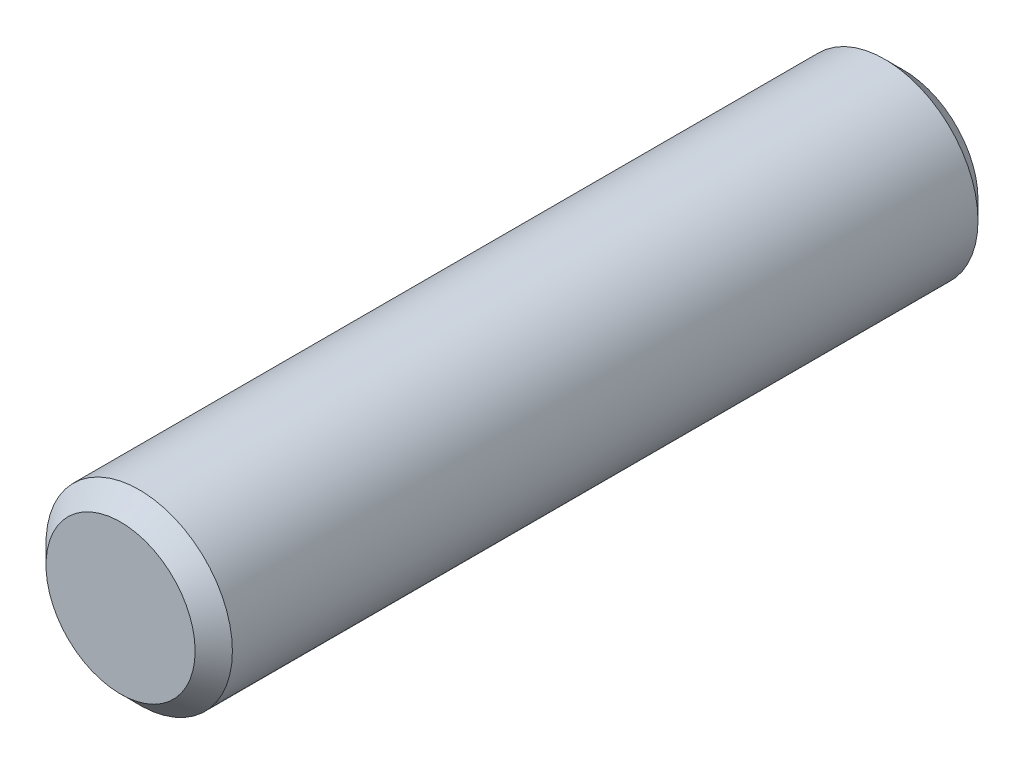
ISO-10303-21;
HEADER;
FILE_DESCRIPTION(('STEP AP214'),'2;1');
FILE_NAME('part.step','',(''),(''),'','','');
FILE_SCHEMA(('AUTOMOTIVE_DESIGN { 1 0 10303 214 1 1 1 1 }'));
ENDSEC;
DATA;
#1=APPLICATION_CONTEXT('core data for automotive mechanical design processes');
#2=APPLICATION_PROTOCOL_DEFINITION('international standard','automotive_design',2000,#1);
#3=PRODUCT_CONTEXT('',#1,'mechanical');
#4=PRODUCT('Part','Part','',(#3));
#5=PRODUCT_RELATED_PRODUCT_CATEGORY('part','',(#4));
#6=PRODUCT_DEFINITION_FORMATION('','',#4);
#7=PRODUCT_DEFINITION_CONTEXT('part definition',#1,'design');
#8=PRODUCT_DEFINITION('design','',#6,#7);
#9=PRODUCT_DEFINITION_SHAPE('','',#8);
#10=(LENGTH_UNIT() NAMED_UNIT(*) SI_UNIT(.MILLI.,.METRE.));
#11=(NAMED_UNIT(*) PLANE_ANGLE_UNIT() SI_UNIT($,.RADIAN.));
#12=(NAMED_UNIT(*) SI_UNIT($,.STERADIAN.) SOLID_ANGLE_UNIT());
#13=UNCERTAINTY_MEASURE_WITH_UNIT(LENGTH_MEASURE(1.E-05),#10,'distance_accuracy_value','');
#14=(GEOMETRIC_REPRESENTATION_CONTEXT(3) GLOBAL_UNCERTAINTY_ASSIGNED_CONTEXT((#13)) GLOBAL_UNIT_ASSIGNED_CONTEXT((#10,
#11,#12)) REPRESENTATION_CONTEXT('',''));
#15=CARTESIAN_POINT('',(0.,0.,0.));
#16=DIRECTION('',(0.,0.,1.));
#17=DIRECTION('',(1.,0.,0.));
#18=AXIS2_PLACEMENT_3D('',#15,#16,#17);
#19=CARTESIAN_POINT('',(0.,0.,84.));
#20=DIRECTION('',(0.,0.,-1.));
#21=DIRECTION('',(-1.,0.,0.));
#22=AXIS2_PLACEMENT_3D('',#19,#20,#21);
#23=CYLINDRICAL_SURFACE('',#22,10.);
#24=CARTESIAN_POINT('',(0.,0.,2.0000000000001));
#25=DIRECTION('',(0.,0.,1.));
#26=DIRECTION('',(1.,0.,0.));
#27=AXIS2_PLACEMENT_3D('',#24,#25,#26);
#28=CIRCLE('',#27,10.);
#29=CARTESIAN_POINT('',(10.,0.,2.0000000000001));
#30=VERTEX_POINT('',#29);
#31=EDGE_CURVE('E23',#30,#30,#28,.T.);
#32=ORIENTED_EDGE('',*,*,#31,.T.);
#33=EDGE_LOOP('',(#32));
#34=FACE_BOUND('',#33,.T.);
#35=CARTESIAN_POINT('',(0.,0.,82.));
#36=DIRECTION('',(0.,0.,1.));
#37=DIRECTION('',(1.,0.,0.));
#38=AXIS2_PLACEMENT_3D('',#35,#36,#37);
#39=CIRCLE('',#38,10.);
#40=CARTESIAN_POINT('',(10.,0.,82.));
#41=VERTEX_POINT('',#40);
#42=EDGE_CURVE('E27',#41,#41,#39,.F.);
#43=ORIENTED_EDGE('',*,*,#42,.T.);
#44=EDGE_LOOP('',(#43));
#45=FACE_BOUND('',#44,.T.);
#46=ADVANCED_FACE('F12',(#34,#45),#23,.T.);
#47=CARTESIAN_POINT('',(0.,0.,84.));
#48=DIRECTION('',(0.,0.,1.));
#49=DIRECTION('',(1.,0.,0.));
#50=AXIS2_PLACEMENT_3D('',#47,#48,#49);
#51=PLANE('',#50);
#52=CARTESIAN_POINT('',(0.,0.,84.));
#53=DIRECTION('',(0.,0.,1.));
#54=DIRECTION('',(1.,0.,0.));
#55=AXIS2_PLACEMENT_3D('',#52,#53,#54);
#56=CIRCLE('',#55,8.);
#57=CARTESIAN_POINT('',(8.,0.,84.));
#58=VERTEX_POINT('',#57);
#59=EDGE_CURVE('E8',#58,#58,#56,.T.);
#60=ORIENTED_EDGE('',*,*,#59,.T.);
#61=EDGE_LOOP('',(#60));
#62=FACE_BOUND('',#61,.T.);
#63=ADVANCED_FACE('F45',(#62),#51,.T.);
#64=CARTESIAN_POINT('',(0.,0.,0.));
#65=DIRECTION('',(0.,0.,1.));
#66=DIRECTION('',(1.,0.,0.));
#67=AXIS2_PLACEMENT_3D('',#64,#65,#66);
#68=PLANE('',#67);
#69=CARTESIAN_POINT('',(0.,0.,0.));
#70=DIRECTION('',(0.,0.,1.));
#71=DIRECTION('',(1.,0.,0.));
#72=AXIS2_PLACEMENT_3D('',#69,#70,#71);
#73=CIRCLE('',#72,7.99999999999988);
#74=CARTESIAN_POINT('',(7.99999999999988,0.,0.));
#75=VERTEX_POINT('',#74);
#76=EDGE_CURVE('E19',#75,#75,#73,.F.);
#77=ORIENTED_EDGE('',*,*,#76,.T.);
#78=EDGE_LOOP('',(#77));
#79=FACE_BOUND('',#78,.T.);
#80=ADVANCED_FACE('F42',(#79),#68,.F.);
#81=CARTESIAN_POINT('',(0.,0.,2.0000000000001));
#82=DIRECTION('',(0.,0.,1.));
#83=DIRECTION('',(1.,0.,0.));
#84=AXIS2_PLACEMENT_3D('',#81,#82,#83);
#85=CONICAL_SURFACE('',#84,10.,0.785398163397453);
#86=ORIENTED_EDGE('',*,*,#76,.F.);
#87=EDGE_LOOP('',(#86));
#88=FACE_BOUND('',#87,.T.);
#89=ORIENTED_EDGE('',*,*,#31,.F.);
#90=EDGE_LOOP('',(#89));
#91=FACE_BOUND('',#90,.T.);
#92=ADVANCED_FACE('F36',(#88,#91),#85,.T.);
#93=CARTESIAN_POINT('',(0.,0.,84.));
#94=DIRECTION('',(0.,0.,-1.));
#95=DIRECTION('',(-1.,0.,0.));
#96=AXIS2_PLACEMENT_3D('',#93,#94,#95);
#97=CONICAL_SURFACE('',#96,8.,0.785398163397446);
#98=ORIENTED_EDGE('',*,*,#42,.F.);
#99=EDGE_LOOP('',(#98));
#100=FACE_BOUND('',#99,.T.);
#101=ORIENTED_EDGE('',*,*,#59,.F.);
#102=EDGE_LOOP('',(#101));
#103=FACE_BOUND('',#102,.T.);
#104=ADVANCED_FACE('F14',(#100,#103),#97,.T.);
#105=CLOSED_SHELL('',(#46,#63,#80,#92,#104));
#106=MANIFOLD_SOLID_BREP('B1',#105);
#107=ADVANCED_BREP_SHAPE_REPRESENTATION('',(#18,#106),#14);
#108=SHAPE_DEFINITION_REPRESENTATION(#9,#107);
ENDSEC;
END-ISO-10303-21;
